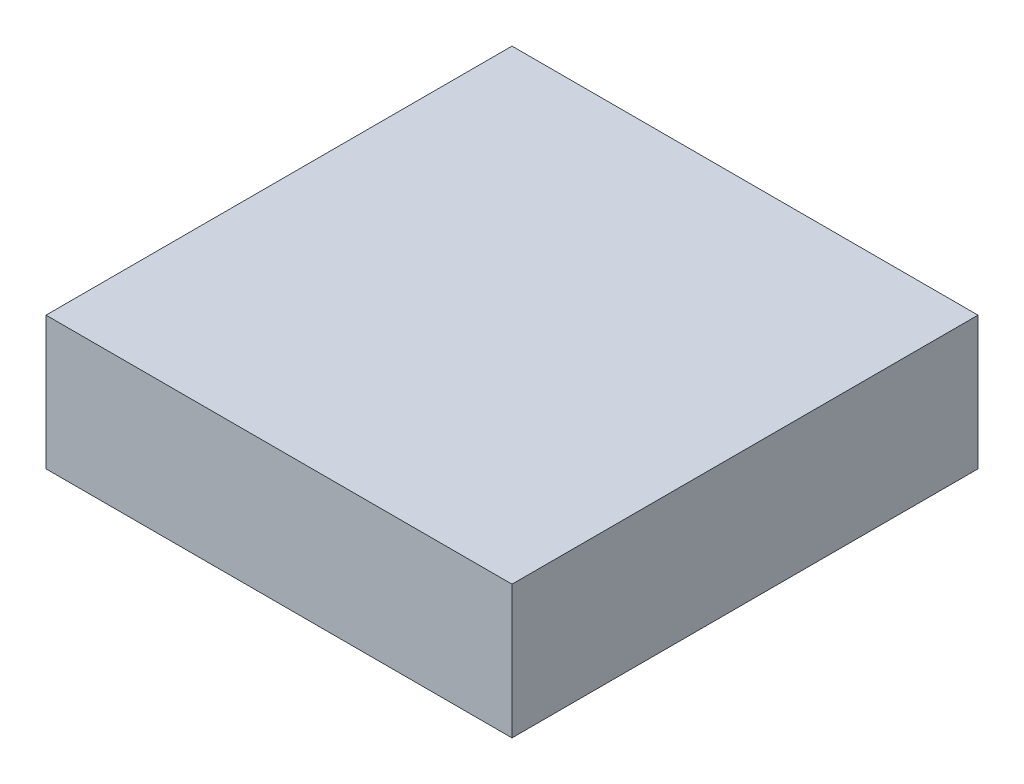
ISO-10303-21;
HEADER;
FILE_DESCRIPTION(('STEP AP214'),'2;1');
FILE_NAME('part.step','',(''),(''),'','','');
FILE_SCHEMA(('AUTOMOTIVE_DESIGN { 1 0 10303 214 1 1 1 1 }'));
ENDSEC;
DATA;
#1=APPLICATION_CONTEXT('core data for automotive mechanical design processes');
#2=APPLICATION_PROTOCOL_DEFINITION('international standard','automotive_design',2000,#1);
#3=PRODUCT_CONTEXT('',#1,'mechanical');
#4=PRODUCT('Part','Part','',(#3));
#5=PRODUCT_RELATED_PRODUCT_CATEGORY('part','',(#4));
#6=PRODUCT_DEFINITION_FORMATION('','',#4);
#7=PRODUCT_DEFINITION_CONTEXT('part definition',#1,'design');
#8=PRODUCT_DEFINITION('design','',#6,#7);
#9=PRODUCT_DEFINITION_SHAPE('','',#8);
#10=(LENGTH_UNIT() NAMED_UNIT(*) SI_UNIT(.MILLI.,.METRE.));
#11=(NAMED_UNIT(*) PLANE_ANGLE_UNIT() SI_UNIT($,.RADIAN.));
#12=(NAMED_UNIT(*) SI_UNIT($,.STERADIAN.) SOLID_ANGLE_UNIT());
#13=UNCERTAINTY_MEASURE_WITH_UNIT(LENGTH_MEASURE(1.E-05),#10,'distance_accuracy_value','');
#14=(GEOMETRIC_REPRESENTATION_CONTEXT(3) GLOBAL_UNCERTAINTY_ASSIGNED_CONTEXT((#13)) GLOBAL_UNIT_ASSIGNED_CONTEXT((#10,
#11,#12)) REPRESENTATION_CONTEXT('',''));
#15=CARTESIAN_POINT('',(0.,0.,0.));
#16=DIRECTION('',(0.,0.,1.));
#17=DIRECTION('',(1.,0.,0.));
#18=AXIS2_PLACEMENT_3D('',#15,#16,#17);
#19=CARTESIAN_POINT('',(1.75,1.,-1.75));
#20=DIRECTION('',(-1.,0.,0.));
#21=DIRECTION('',(0.,0.,1.));
#22=AXIS2_PLACEMENT_3D('',#19,#20,#21);
#23=PLANE('',#22);
#24=DIRECTION('',(0.,0.,-1.));
#25=VECTOR('',#24,1.);
#26=CARTESIAN_POINT('',(1.75,0.,-1.75));
#27=LINE('',#26,#25);
#28=CARTESIAN_POINT('',(1.75,0.,1.75));
#29=VERTEX_POINT('',#28);
#30=CARTESIAN_POINT('',(1.75,0.,-1.75));
#31=VERTEX_POINT('',#30);
#32=EDGE_CURVE('E101',#29,#31,#27,.T.);
#33=ORIENTED_EDGE('',*,*,#32,.T.);
#34=DIRECTION('',(0.,-1.,0.));
#35=VECTOR('',#34,1.);
#36=CARTESIAN_POINT('',(1.75,1.,-1.75));
#37=LINE('',#36,#35);
#38=CARTESIAN_POINT('',(1.75,1.,-1.75));
#39=VERTEX_POINT('',#38);
#40=EDGE_CURVE('E11',#39,#31,#37,.T.);
#41=ORIENTED_EDGE('',*,*,#40,.F.);
#42=DIRECTION('',(0.,0.,-1.));
#43=VECTOR('',#42,1.);
#44=CARTESIAN_POINT('',(1.75,1.,-1.75));
#45=LINE('',#44,#43);
#46=CARTESIAN_POINT('',(1.75,1.,1.75));
#47=VERTEX_POINT('',#46);
#48=EDGE_CURVE('E89',#47,#39,#45,.T.);
#49=ORIENTED_EDGE('',*,*,#48,.F.);
#50=DIRECTION('',(0.,-1.,0.));
#51=VECTOR('',#50,1.);
#52=CARTESIAN_POINT('',(1.75,1.,1.75));
#53=LINE('',#52,#51);
#54=EDGE_CURVE('E97',#47,#29,#53,.T.);
#55=ORIENTED_EDGE('',*,*,#54,.T.);
#56=EDGE_LOOP('',(#33,#41,#49,#55));
#57=FACE_BOUND('',#56,.T.);
#58=ADVANCED_FACE('F37',(#57),#23,.F.);
#59=CARTESIAN_POINT('',(-1.75,1.,-1.75));
#60=DIRECTION('',(0.,0.,1.));
#61=DIRECTION('',(1.,0.,0.));
#62=AXIS2_PLACEMENT_3D('',#59,#60,#61);
#63=PLANE('',#62);
#64=DIRECTION('',(-1.,0.,0.));
#65=VECTOR('',#64,1.);
#66=CARTESIAN_POINT('',(-1.75,0.,-1.75));
#67=LINE('',#66,#65);
#68=CARTESIAN_POINT('',(-1.75,0.,-1.75));
#69=VERTEX_POINT('',#68);
#70=EDGE_CURVE('E93',#31,#69,#67,.T.);
#71=ORIENTED_EDGE('',*,*,#70,.T.);
#72=DIRECTION('',(0.,-1.,0.));
#73=VECTOR('',#72,1.);
#74=CARTESIAN_POINT('',(-1.75,1.,-1.75));
#75=LINE('',#74,#73);
#76=CARTESIAN_POINT('',(-1.75,1.,-1.75));
#77=VERTEX_POINT('',#76);
#78=EDGE_CURVE('E45',#77,#69,#75,.T.);
#79=ORIENTED_EDGE('',*,*,#78,.F.);
#80=DIRECTION('',(-1.,0.,0.));
#81=VECTOR('',#80,1.);
#82=CARTESIAN_POINT('',(-1.75,1.,-1.75));
#83=LINE('',#82,#81);
#84=EDGE_CURVE('E84',#39,#77,#83,.T.);
#85=ORIENTED_EDGE('',*,*,#84,.F.);
#86=ORIENTED_EDGE('',*,*,#40,.T.);
#87=EDGE_LOOP('',(#71,#79,#85,#86));
#88=FACE_BOUND('',#87,.T.);
#89=ADVANCED_FACE('F92',(#88),#63,.F.);
#90=CARTESIAN_POINT('',(-1.75,1.,-1.75));
#91=DIRECTION('',(1.,0.,0.));
#92=DIRECTION('',(0.,0.,-1.));
#93=AXIS2_PLACEMENT_3D('',#90,#91,#92);
#94=PLANE('',#93);
#95=DIRECTION('',(0.,0.,1.));
#96=VECTOR('',#95,1.);
#97=CARTESIAN_POINT('',(-1.75,0.,-1.75));
#98=LINE('',#97,#96);
#99=CARTESIAN_POINT('',(-1.75,0.,1.75));
#100=VERTEX_POINT('',#99);
#101=EDGE_CURVE('E70',#69,#100,#98,.T.);
#102=ORIENTED_EDGE('',*,*,#101,.T.);
#103=DIRECTION('',(0.,-1.,0.));
#104=VECTOR('',#103,1.);
#105=CARTESIAN_POINT('',(-1.75,1.,1.75));
#106=LINE('',#105,#104);
#107=CARTESIAN_POINT('',(-1.75,1.,1.75));
#108=VERTEX_POINT('',#107);
#109=EDGE_CURVE('E94',#108,#100,#106,.T.);
#110=ORIENTED_EDGE('',*,*,#109,.F.);
#111=DIRECTION('',(0.,0.,1.));
#112=VECTOR('',#111,1.);
#113=CARTESIAN_POINT('',(-1.75,1.,-1.75));
#114=LINE('',#113,#112);
#115=EDGE_CURVE('E87',#77,#108,#114,.T.);
#116=ORIENTED_EDGE('',*,*,#115,.F.);
#117=ORIENTED_EDGE('',*,*,#78,.T.);
#118=EDGE_LOOP('',(#102,#110,#116,#117));
#119=FACE_BOUND('',#118,.T.);
#120=ADVANCED_FACE('F95',(#119),#94,.F.);
#121=CARTESIAN_POINT('',(-1.75,1.,1.75));
#122=DIRECTION('',(0.,0.,-1.));
#123=DIRECTION('',(-1.,0.,0.));
#124=AXIS2_PLACEMENT_3D('',#121,#122,#123);
#125=PLANE('',#124);
#126=DIRECTION('',(1.,0.,0.));
#127=VECTOR('',#126,1.);
#128=CARTESIAN_POINT('',(-1.75,0.,1.75));
#129=LINE('',#128,#127);
#130=EDGE_CURVE('E77',#100,#29,#129,.T.);
#131=ORIENTED_EDGE('',*,*,#130,.T.);
#132=ORIENTED_EDGE('',*,*,#54,.F.);
#133=DIRECTION('',(1.,0.,0.));
#134=VECTOR('',#133,1.);
#135=CARTESIAN_POINT('',(-1.75,1.,1.75));
#136=LINE('',#135,#134);
#137=EDGE_CURVE('E53',#108,#47,#136,.T.);
#138=ORIENTED_EDGE('',*,*,#137,.F.);
#139=ORIENTED_EDGE('',*,*,#109,.T.);
#140=EDGE_LOOP('',(#131,#132,#138,#139));
#141=FACE_BOUND('',#140,.T.);
#142=ADVANCED_FACE('F111',(#141),#125,.F.);
#143=CARTESIAN_POINT('',(0.,1.,0.));
#144=DIRECTION('',(0.,1.,0.));
#145=DIRECTION('',(0.,0.,1.));
#146=AXIS2_PLACEMENT_3D('',#143,#144,#145);
#147=PLANE('',#146);
#148=ORIENTED_EDGE('',*,*,#48,.T.);
#149=ORIENTED_EDGE('',*,*,#84,.T.);
#150=ORIENTED_EDGE('',*,*,#115,.T.);
#151=ORIENTED_EDGE('',*,*,#137,.T.);
#152=EDGE_LOOP('',(#148,#149,#150,#151));
#153=FACE_BOUND('',#152,.T.);
#154=ADVANCED_FACE('F85',(#153),#147,.T.);
#155=CARTESIAN_POINT('',(0.,0.,0.));
#156=DIRECTION('',(0.,1.,0.));
#157=DIRECTION('',(0.,0.,1.));
#158=AXIS2_PLACEMENT_3D('',#155,#156,#157);
#159=PLANE('',#158);
#160=ORIENTED_EDGE('',*,*,#32,.F.);
#161=ORIENTED_EDGE('',*,*,#130,.F.);
#162=ORIENTED_EDGE('',*,*,#101,.F.);
#163=ORIENTED_EDGE('',*,*,#70,.F.);
#164=EDGE_LOOP('',(#160,#161,#162,#163));
#165=FACE_BOUND('',#164,.T.);
#166=ADVANCED_FACE('F114',(#165),#159,.F.);
#167=CLOSED_SHELL('',(#58,#89,#120,#142,#154,#166));
#168=CARTESIAN_POINT('',(0.,0.9,0.));
#169=DIRECTION('',(0.,1.,0.));
#170=DIRECTION('',(0.,0.,1.));
#171=AXIS2_PLACEMENT_3D('',#168,#169,#170);
#172=PLANE('',#171);
#173=CARTESIAN_POINT('',(0.,0.9,0.));
#174=DIRECTION('',(0.,-1.,0.));
#175=DIRECTION('',(0.,0.,-1.));
#176=AXIS2_PLACEMENT_3D('',#173,#174,#175);
#177=CIRCLE('',#176,1.5);
#178=CARTESIAN_POINT('',(0.,0.9,-1.5));
#179=VERTEX_POINT('',#178);
#180=EDGE_CURVE('E105',#179,#179,#177,.T.);
#181=ORIENTED_EDGE('',*,*,#180,.T.);
#182=EDGE_LOOP('',(#181));
#183=FACE_BOUND('',#182,.T.);
#184=ADVANCED_FACE('F134',(#183),#172,.F.);
#185=CARTESIAN_POINT('',(0.,0.2,0.));
#186=DIRECTION('',(0.,1.,0.));
#187=DIRECTION('',(0.,0.,1.));
#188=AXIS2_PLACEMENT_3D('',#185,#186,#187);
#189=CONICAL_SURFACE('',#188,1.3,0.278299659005111);
#190=ORIENTED_EDGE('',*,*,#180,.F.);
#191=EDGE_LOOP('',(#190));
#192=FACE_BOUND('',#191,.T.);
#193=CARTESIAN_POINT('',(0.,0.2,0.));
#194=DIRECTION('',(0.,-1.,0.));
#195=DIRECTION('',(0.,0.,-1.));
#196=AXIS2_PLACEMENT_3D('',#193,#194,#195);
#197=CIRCLE('',#196,1.3);
#198=CARTESIAN_POINT('',(0.,0.2,-1.3));
#199=VERTEX_POINT('',#198);
#200=EDGE_CURVE('E120',#199,#199,#197,.T.);
#201=ORIENTED_EDGE('',*,*,#200,.T.);
#202=EDGE_LOOP('',(#201));
#203=FACE_BOUND('',#202,.T.);
#204=ADVANCED_FACE('F125',(#192,#203),#189,.F.);
#205=CARTESIAN_POINT('',(0.,0.2,-1.3));
#206=DIRECTION('',(0.,-1.,0.));
#207=DIRECTION('',(0.,0.,-1.));
#208=AXIS2_PLACEMENT_3D('',#205,#206,#207);
#209=PLANE('',#208);
#210=ORIENTED_EDGE('',*,*,#200,.F.);
#211=EDGE_LOOP('',(#210));
#212=FACE_BOUND('',#211,.T.);
#213=ADVANCED_FACE('F127',(#212),#209,.F.);
#214=CLOSED_SHELL('',(#184,#204,#213));
#215=ORIENTED_CLOSED_SHELL('',*,#214,.T.);
#216=BREP_WITH_VOIDS('B2',#167,(#215));
#217=ADVANCED_BREP_SHAPE_REPRESENTATION('',(#18,#216),#14);
#218=SHAPE_DEFINITION_REPRESENTATION(#9,#217);
ENDSEC;
END-ISO-10303-21;
